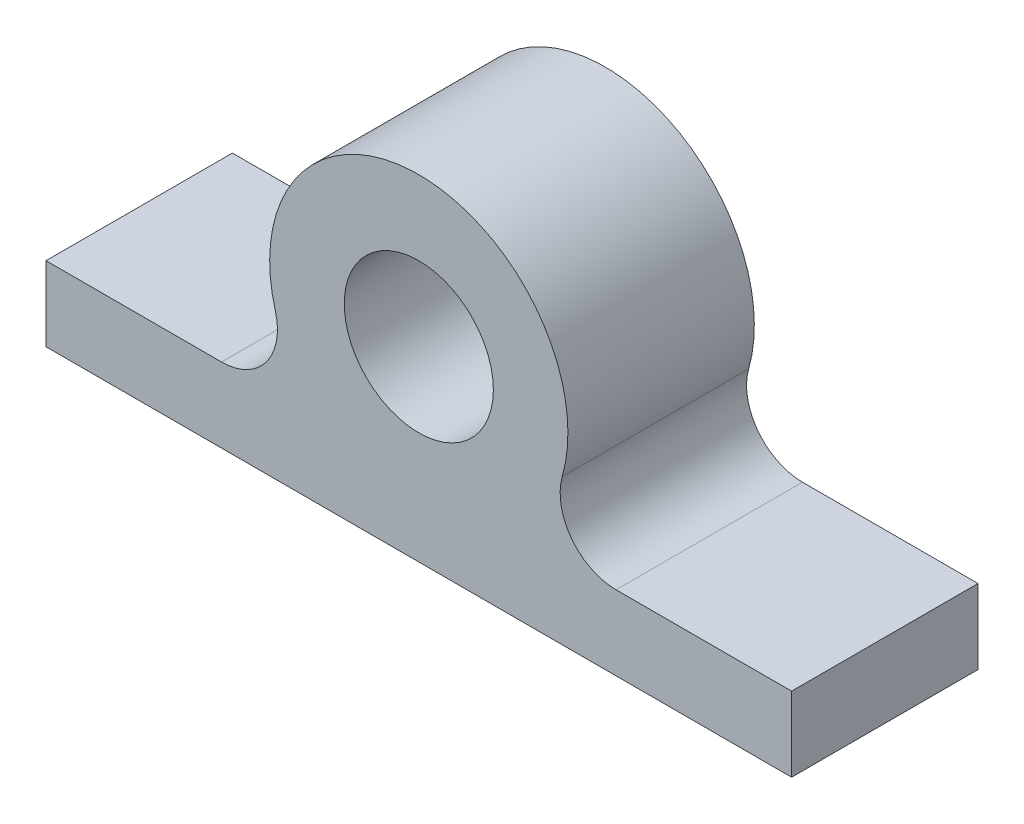
ISO-10303-21;
HEADER;
FILE_DESCRIPTION(('STEP AP214'),'2;1');
FILE_NAME('part.step','',(''),(''),'','','');
FILE_SCHEMA(('AUTOMOTIVE_DESIGN { 1 0 10303 214 1 1 1 1 }'));
ENDSEC;
DATA;
#1=APPLICATION_CONTEXT('core data for automotive mechanical design processes');
#2=APPLICATION_PROTOCOL_DEFINITION('international standard','automotive_design',2000,#1);
#3=PRODUCT_CONTEXT('',#1,'mechanical');
#4=PRODUCT('Part','Part','',(#3));
#5=PRODUCT_RELATED_PRODUCT_CATEGORY('part','',(#4));
#6=PRODUCT_DEFINITION_FORMATION('','',#4);
#7=PRODUCT_DEFINITION_CONTEXT('part definition',#1,'design');
#8=PRODUCT_DEFINITION('design','',#6,#7);
#9=PRODUCT_DEFINITION_SHAPE('','',#8);
#10=(LENGTH_UNIT() NAMED_UNIT(*) SI_UNIT(.MILLI.,.METRE.));
#11=(NAMED_UNIT(*) PLANE_ANGLE_UNIT() SI_UNIT($,.RADIAN.));
#12=(NAMED_UNIT(*) SI_UNIT($,.STERADIAN.) SOLID_ANGLE_UNIT());
#13=UNCERTAINTY_MEASURE_WITH_UNIT(LENGTH_MEASURE(1.E-05),#10,'distance_accuracy_value','');
#14=(GEOMETRIC_REPRESENTATION_CONTEXT(3) GLOBAL_UNCERTAINTY_ASSIGNED_CONTEXT((#13)) GLOBAL_UNIT_ASSIGNED_CONTEXT((#10,
#11,#12)) REPRESENTATION_CONTEXT('',''));
#15=CARTESIAN_POINT('',(0.,0.,0.));
#16=DIRECTION('',(0.,0.,1.));
#17=DIRECTION('',(1.,0.,0.));
#18=AXIS2_PLACEMENT_3D('',#15,#16,#17);
#19=CARTESIAN_POINT('',(0.,0.,-10.));
#20=DIRECTION('',(0.,0.,1.));
#21=DIRECTION('',(1.,0.,0.));
#22=AXIS2_PLACEMENT_3D('',#19,#20,#21);
#23=CYLINDRICAL_SURFACE('',#22,8.);
#24=CARTESIAN_POINT('',(0.,0.,0.));
#25=DIRECTION('',(0.,0.,1.));
#26=DIRECTION('',(1.,0.,0.));
#27=AXIS2_PLACEMENT_3D('',#24,#25,#26);
#28=CIRCLE('',#27,8.);
#29=CARTESIAN_POINT('',(7.69673108673335,-2.18181818181818,0.));
#30=VERTEX_POINT('',#29);
#31=CARTESIAN_POINT('',(-7.69673108673335,-2.18181818181818,0.));
#32=VERTEX_POINT('',#31);
#33=EDGE_CURVE('E171',#30,#32,#28,.T.);
#34=ORIENTED_EDGE('',*,*,#33,.F.);
#35=DIRECTION('',(0.,0.,1.));
#36=VECTOR('',#35,1.);
#37=CARTESIAN_POINT('',(7.69673108673335,-2.18181818181818,-10.));
#38=LINE('',#37,#36);
#39=CARTESIAN_POINT('',(7.69673108673335,-2.18181818181818,-10.));
#40=VERTEX_POINT('',#39);
#41=EDGE_CURVE('E185',#30,#40,#38,.F.);
#42=ORIENTED_EDGE('',*,*,#41,.T.);
#43=CARTESIAN_POINT('',(0.,0.,-10.));
#44=DIRECTION('',(0.,0.,1.));
#45=DIRECTION('',(1.,0.,0.));
#46=AXIS2_PLACEMENT_3D('',#43,#44,#45);
#47=CIRCLE('',#46,8.);
#48=CARTESIAN_POINT('',(-7.69673108673335,-2.18181818181818,-10.));
#49=VERTEX_POINT('',#48);
#50=EDGE_CURVE('E175',#40,#49,#47,.T.);
#51=ORIENTED_EDGE('',*,*,#50,.T.);
#52=DIRECTION('',(0.,0.,1.));
#53=VECTOR('',#52,1.);
#54=CARTESIAN_POINT('',(-7.69673108673335,-2.18181818181818,-10.));
#55=LINE('',#54,#53);
#56=EDGE_CURVE('E179',#49,#32,#55,.T.);
#57=ORIENTED_EDGE('',*,*,#56,.T.);
#58=EDGE_LOOP('',(#34,#42,#51,#57));
#59=FACE_BOUND('',#58,.T.);
#60=ADVANCED_FACE('F45',(#59),#23,.T.);
#61=CARTESIAN_POINT('',(0.,0.,-10.));
#62=DIRECTION('',(0.,0.,1.));
#63=DIRECTION('',(1.,0.,0.));
#64=AXIS2_PLACEMENT_3D('',#61,#62,#63);
#65=PLANE('',#64);
#66=ORIENTED_EDGE('',*,*,#50,.F.);
#67=CARTESIAN_POINT('',(10.5830052442584,-3.,-10.));
#68=DIRECTION('',(0.,0.,1.));
#69=DIRECTION('',(1.,0.,0.));
#70=AXIS2_PLACEMENT_3D('',#67,#68,#69);
#71=CIRCLE('',#70,3.);
#72=CARTESIAN_POINT('',(10.5830052442584,-6.,-10.));
#73=VERTEX_POINT('',#72);
#74=EDGE_CURVE('E194',#40,#73,#71,.T.);
#75=ORIENTED_EDGE('',*,*,#74,.T.);
#76=DIRECTION('',(1.,0.,0.));
#77=VECTOR('',#76,1.);
#78=CARTESIAN_POINT('',(20.,-6.,-10.));
#79=LINE('',#78,#77);
#80=CARTESIAN_POINT('',(20.,-6.,-10.));
#81=VERTEX_POINT('',#80);
#82=EDGE_CURVE('E130',#73,#81,#79,.T.);
#83=ORIENTED_EDGE('',*,*,#82,.T.);
#84=DIRECTION('',(0.,1.,0.));
#85=VECTOR('',#84,1.);
#86=CARTESIAN_POINT('',(20.,-10.,-10.));
#87=LINE('',#86,#85);
#88=CARTESIAN_POINT('',(20.,-10.,-10.));
#89=VERTEX_POINT('',#88);
#90=EDGE_CURVE('E123',#89,#81,#87,.T.);
#91=ORIENTED_EDGE('',*,*,#90,.F.);
#92=DIRECTION('',(1.,0.,0.));
#93=VECTOR('',#92,1.);
#94=CARTESIAN_POINT('',(20.,-10.,-10.));
#95=LINE('',#94,#93);
#96=CARTESIAN_POINT('',(-20.,-10.,-10.));
#97=VERTEX_POINT('',#96);
#98=EDGE_CURVE('E116',#97,#89,#95,.T.);
#99=ORIENTED_EDGE('',*,*,#98,.F.);
#100=DIRECTION('',(0.,1.,0.));
#101=VECTOR('',#100,1.);
#102=CARTESIAN_POINT('',(-20.,-10.,-10.));
#103=LINE('',#102,#101);
#104=CARTESIAN_POINT('',(-20.,-6.,-10.));
#105=VERTEX_POINT('',#104);
#106=EDGE_CURVE('E109',#97,#105,#103,.T.);
#107=ORIENTED_EDGE('',*,*,#106,.T.);
#108=CARTESIAN_POINT('',(-10.5830052442584,-6.,-10.));
#109=VERTEX_POINT('',#108);
#110=EDGE_CURVE('E113',#105,#109,#79,.T.);
#111=ORIENTED_EDGE('',*,*,#110,.T.);
#112=CARTESIAN_POINT('',(-10.5830052442584,-3.,-10.));
#113=DIRECTION('',(0.,0.,1.));
#114=DIRECTION('',(1.,0.,0.));
#115=AXIS2_PLACEMENT_3D('',#112,#113,#114);
#116=CIRCLE('',#115,3.);
#117=EDGE_CURVE('E11',#109,#49,#116,.T.);
#118=ORIENTED_EDGE('',*,*,#117,.T.);
#119=EDGE_LOOP('',(#66,#75,#83,#91,#99,#107,#111,#118));
#120=FACE_BOUND('',#119,.T.);
#121=CARTESIAN_POINT('',(0.,0.,-10.));
#122=DIRECTION('',(0.,0.,1.));
#123=DIRECTION('',(1.,0.,0.));
#124=AXIS2_PLACEMENT_3D('',#121,#122,#123);
#125=CIRCLE('',#124,4.);
#126=CARTESIAN_POINT('',(4.,0.,-10.));
#127=VERTEX_POINT('',#126);
#128=EDGE_CURVE('E167',#127,#127,#125,.T.);
#129=ORIENTED_EDGE('',*,*,#128,.T.);
#130=EDGE_LOOP('',(#129));
#131=FACE_BOUND('',#130,.T.);
#132=ADVANCED_FACE('F111',(#120,#131),#65,.F.);
#133=CARTESIAN_POINT('',(0.,0.,0.));
#134=DIRECTION('',(0.,0.,1.));
#135=DIRECTION('',(1.,0.,0.));
#136=AXIS2_PLACEMENT_3D('',#133,#134,#135);
#137=PLANE('',#136);
#138=DIRECTION('',(-1.,0.,0.));
#139=VECTOR('',#138,1.);
#140=CARTESIAN_POINT('',(20.,-6.,0.));
#141=LINE('',#140,#139);
#142=CARTESIAN_POINT('',(20.,-6.,0.));
#143=VERTEX_POINT('',#142);
#144=CARTESIAN_POINT('',(10.5830052442584,-6.,0.));
#145=VERTEX_POINT('',#144);
#146=EDGE_CURVE('E144',#143,#145,#141,.T.);
#147=ORIENTED_EDGE('',*,*,#146,.T.);
#148=CARTESIAN_POINT('',(10.5830052442584,-3.,0.));
#149=DIRECTION('',(0.,0.,1.));
#150=DIRECTION('',(1.,0.,0.));
#151=AXIS2_PLACEMENT_3D('',#148,#149,#150);
#152=CIRCLE('',#151,3.);
#153=EDGE_CURVE('E197',#145,#30,#152,.F.);
#154=ORIENTED_EDGE('',*,*,#153,.T.);
#155=ORIENTED_EDGE('',*,*,#33,.T.);
#156=CARTESIAN_POINT('',(-10.5830052442584,-3.,0.));
#157=DIRECTION('',(0.,0.,1.));
#158=DIRECTION('',(1.,0.,0.));
#159=AXIS2_PLACEMENT_3D('',#156,#157,#158);
#160=CIRCLE('',#159,3.);
#161=CARTESIAN_POINT('',(-10.5830052442584,-6.,0.));
#162=VERTEX_POINT('',#161);
#163=EDGE_CURVE('E54',#32,#162,#160,.F.);
#164=ORIENTED_EDGE('',*,*,#163,.T.);
#165=CARTESIAN_POINT('',(-20.,-6.,0.));
#166=VERTEX_POINT('',#165);
#167=EDGE_CURVE('E143',#162,#166,#141,.T.);
#168=ORIENTED_EDGE('',*,*,#167,.T.);
#169=DIRECTION('',(0.,1.,0.));
#170=VECTOR('',#169,1.);
#171=CARTESIAN_POINT('',(-20.,-10.,0.));
#172=LINE('',#171,#170);
#173=CARTESIAN_POINT('',(-20.,-10.,0.));
#174=VERTEX_POINT('',#173);
#175=EDGE_CURVE('E135',#174,#166,#172,.T.);
#176=ORIENTED_EDGE('',*,*,#175,.F.);
#177=DIRECTION('',(-1.,0.,0.));
#178=VECTOR('',#177,1.);
#179=CARTESIAN_POINT('',(20.,-10.,0.));
#180=LINE('',#179,#178);
#181=CARTESIAN_POINT('',(20.,-10.,0.));
#182=VERTEX_POINT('',#181);
#183=EDGE_CURVE('E156',#182,#174,#180,.T.);
#184=ORIENTED_EDGE('',*,*,#183,.F.);
#185=DIRECTION('',(0.,1.,0.));
#186=VECTOR('',#185,1.);
#187=CARTESIAN_POINT('',(20.,-10.,0.));
#188=LINE('',#187,#186);
#189=EDGE_CURVE('E161',#182,#143,#188,.T.);
#190=ORIENTED_EDGE('',*,*,#189,.T.);
#191=EDGE_LOOP('',(#147,#154,#155,#164,#168,#176,#184,#190));
#192=FACE_BOUND('',#191,.T.);
#193=CARTESIAN_POINT('',(0.,0.,0.));
#194=DIRECTION('',(0.,0.,1.));
#195=DIRECTION('',(1.,0.,0.));
#196=AXIS2_PLACEMENT_3D('',#193,#194,#195);
#197=CIRCLE('',#196,4.);
#198=CARTESIAN_POINT('',(4.,0.,0.));
#199=VERTEX_POINT('',#198);
#200=EDGE_CURVE('E122',#199,#199,#197,.T.);
#201=ORIENTED_EDGE('',*,*,#200,.F.);
#202=EDGE_LOOP('',(#201));
#203=FACE_BOUND('',#202,.T.);
#204=ADVANCED_FACE('F201',(#192,#203),#137,.T.);
#205=CARTESIAN_POINT('',(0.,0.,-10.));
#206=DIRECTION('',(0.,0.,1.));
#207=DIRECTION('',(1.,0.,0.));
#208=AXIS2_PLACEMENT_3D('',#205,#206,#207);
#209=CYLINDRICAL_SURFACE('',#208,4.);
#210=ORIENTED_EDGE('',*,*,#128,.F.);
#211=EDGE_LOOP('',(#210));
#212=FACE_BOUND('',#211,.T.);
#213=ORIENTED_EDGE('',*,*,#200,.T.);
#214=EDGE_LOOP('',(#213));
#215=FACE_BOUND('',#214,.T.);
#216=ADVANCED_FACE('F284',(#212,#215),#209,.F.);
#217=CARTESIAN_POINT('',(0.,-6.,0.));
#218=DIRECTION('',(0.,-1.,0.));
#219=DIRECTION('',(0.,0.,-1.));
#220=AXIS2_PLACEMENT_3D('',#217,#218,#219);
#221=PLANE('',#220);
#222=ORIENTED_EDGE('',*,*,#82,.F.);
#223=DIRECTION('',(0.,0.,1.));
#224=VECTOR('',#223,1.);
#225=CARTESIAN_POINT('',(10.5830052442584,-6.,0.));
#226=LINE('',#225,#224);
#227=EDGE_CURVE('E189',#73,#145,#226,.T.);
#228=ORIENTED_EDGE('',*,*,#227,.T.);
#229=ORIENTED_EDGE('',*,*,#146,.F.);
#230=DIRECTION('',(0.,0.,1.));
#231=VECTOR('',#230,1.);
#232=CARTESIAN_POINT('',(20.,-6.,-10.));
#233=LINE('',#232,#231);
#234=EDGE_CURVE('E129',#81,#143,#233,.T.);
#235=ORIENTED_EDGE('',*,*,#234,.F.);
#236=EDGE_LOOP('',(#222,#228,#229,#235));
#237=FACE_BOUND('',#236,.T.);
#238=ADVANCED_FACE('F216',(#237),#221,.F.);
#239=CARTESIAN_POINT('',(-20.,-10.,-10.));
#240=DIRECTION('',(1.,0.,0.));
#241=DIRECTION('',(0.,0.,-1.));
#242=AXIS2_PLACEMENT_3D('',#239,#240,#241);
#243=PLANE('',#242);
#244=ORIENTED_EDGE('',*,*,#175,.T.);
#245=DIRECTION('',(0.,0.,-1.));
#246=VECTOR('',#245,1.);
#247=CARTESIAN_POINT('',(-20.,-6.,-10.));
#248=LINE('',#247,#246);
#249=EDGE_CURVE('E127',#166,#105,#248,.T.);
#250=ORIENTED_EDGE('',*,*,#249,.T.);
#251=ORIENTED_EDGE('',*,*,#106,.F.);
#252=DIRECTION('',(0.,0.,-1.));
#253=VECTOR('',#252,1.);
#254=CARTESIAN_POINT('',(-20.,-10.,-10.));
#255=LINE('',#254,#253);
#256=EDGE_CURVE('E148',#174,#97,#255,.T.);
#257=ORIENTED_EDGE('',*,*,#256,.F.);
#258=EDGE_LOOP('',(#244,#250,#251,#257));
#259=FACE_BOUND('',#258,.T.);
#260=ADVANCED_FACE('F133',(#259),#243,.F.);
#261=CARTESIAN_POINT('',(20.,-10.,-10.));
#262=DIRECTION('',(-1.,0.,0.));
#263=DIRECTION('',(0.,0.,1.));
#264=AXIS2_PLACEMENT_3D('',#261,#262,#263);
#265=PLANE('',#264);
#266=ORIENTED_EDGE('',*,*,#90,.T.);
#267=ORIENTED_EDGE('',*,*,#234,.T.);
#268=ORIENTED_EDGE('',*,*,#189,.F.);
#269=DIRECTION('',(0.,0.,1.));
#270=VECTOR('',#269,1.);
#271=CARTESIAN_POINT('',(20.,-10.,-10.));
#272=LINE('',#271,#270);
#273=EDGE_CURVE('E153',#89,#182,#272,.T.);
#274=ORIENTED_EDGE('',*,*,#273,.F.);
#275=EDGE_LOOP('',(#266,#267,#268,#274));
#276=FACE_BOUND('',#275,.T.);
#277=ADVANCED_FACE('F220',(#276),#265,.F.);
#278=CARTESIAN_POINT('',(0.,-10.,0.));
#279=DIRECTION('',(0.,-1.,0.));
#280=DIRECTION('',(0.,0.,-1.));
#281=AXIS2_PLACEMENT_3D('',#278,#279,#280);
#282=PLANE('',#281);
#283=ORIENTED_EDGE('',*,*,#256,.T.);
#284=ORIENTED_EDGE('',*,*,#98,.T.);
#285=ORIENTED_EDGE('',*,*,#273,.T.);
#286=ORIENTED_EDGE('',*,*,#183,.T.);
#287=EDGE_LOOP('',(#283,#284,#285,#286));
#288=FACE_BOUND('',#287,.T.);
#289=ADVANCED_FACE('F223',(#288),#282,.T.);
#290=ORIENTED_EDGE('',*,*,#167,.F.);
#291=DIRECTION('',(0.,0.,1.));
#292=VECTOR('',#291,1.);
#293=CARTESIAN_POINT('',(-10.5830052442584,-6.,0.));
#294=LINE('',#293,#292);
#295=EDGE_CURVE('E67',#162,#109,#294,.F.);
#296=ORIENTED_EDGE('',*,*,#295,.T.);
#297=ORIENTED_EDGE('',*,*,#110,.F.);
#298=ORIENTED_EDGE('',*,*,#249,.F.);
#299=EDGE_LOOP('',(#290,#296,#297,#298));
#300=FACE_BOUND('',#299,.T.);
#301=ADVANCED_FACE('F126',(#300),#221,.F.);
#302=CARTESIAN_POINT('',(10.5830052442584,-3.,-10.));
#303=DIRECTION('',(0.,0.,1.));
#304=DIRECTION('',(1.,0.,0.));
#305=AXIS2_PLACEMENT_3D('',#302,#303,#304);
#306=CYLINDRICAL_SURFACE('',#305,3.);
#307=ORIENTED_EDGE('',*,*,#153,.F.);
#308=ORIENTED_EDGE('',*,*,#227,.F.);
#309=ORIENTED_EDGE('',*,*,#74,.F.);
#310=ORIENTED_EDGE('',*,*,#41,.F.);
#311=EDGE_LOOP('',(#307,#308,#309,#310));
#312=FACE_BOUND('',#311,.T.);
#313=ADVANCED_FACE('F211',(#312),#306,.F.);
#314=CARTESIAN_POINT('',(-10.5830052442584,-3.,-10.));
#315=DIRECTION('',(0.,0.,1.));
#316=DIRECTION('',(1.,0.,0.));
#317=AXIS2_PLACEMENT_3D('',#314,#315,#316);
#318=CYLINDRICAL_SURFACE('',#317,3.);
#319=ORIENTED_EDGE('',*,*,#117,.F.);
#320=ORIENTED_EDGE('',*,*,#295,.F.);
#321=ORIENTED_EDGE('',*,*,#163,.F.);
#322=ORIENTED_EDGE('',*,*,#56,.F.);
#323=EDGE_LOOP('',(#319,#320,#321,#322));
#324=FACE_BOUND('',#323,.T.);
#325=ADVANCED_FACE('F47',(#324),#318,.F.);
#326=CLOSED_SHELL('',(#60,#132,#204,#216,#238,#260,#277,#289,#301,#313,#325));
#327=MANIFOLD_SOLID_BREP('B2',#326);
#328=ADVANCED_BREP_SHAPE_REPRESENTATION('',(#18,#327),#14);
#329=SHAPE_DEFINITION_REPRESENTATION(#9,#328);
ENDSEC;
END-ISO-10303-21;
